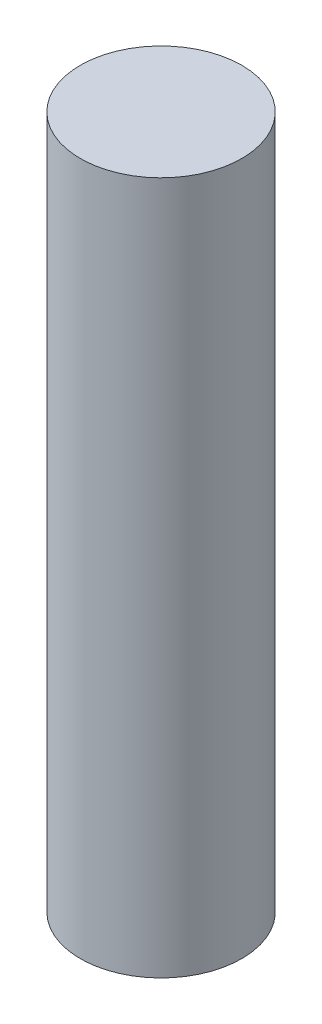
ISO-10303-21;
HEADER;
FILE_DESCRIPTION(('STEP AP214'),'2;1');
FILE_NAME('part.step','',(''),(''),'','','');
FILE_SCHEMA(('AUTOMOTIVE_DESIGN { 1 0 10303 214 1 1 1 1 }'));
ENDSEC;
DATA;
#1=APPLICATION_CONTEXT('core data for automotive mechanical design processes');
#2=APPLICATION_PROTOCOL_DEFINITION('international standard','automotive_design',2000,#1);
#3=PRODUCT_CONTEXT('',#1,'mechanical');
#4=PRODUCT('Part','Part','',(#3));
#5=PRODUCT_RELATED_PRODUCT_CATEGORY('part','',(#4));
#6=PRODUCT_DEFINITION_FORMATION('','',#4);
#7=PRODUCT_DEFINITION_CONTEXT('part definition',#1,'design');
#8=PRODUCT_DEFINITION('design','',#6,#7);
#9=PRODUCT_DEFINITION_SHAPE('','',#8);
#10=(LENGTH_UNIT() NAMED_UNIT(*) SI_UNIT(.MILLI.,.METRE.));
#11=(NAMED_UNIT(*) PLANE_ANGLE_UNIT() SI_UNIT($,.RADIAN.));
#12=(NAMED_UNIT(*) SI_UNIT($,.STERADIAN.) SOLID_ANGLE_UNIT());
#13=UNCERTAINTY_MEASURE_WITH_UNIT(LENGTH_MEASURE(1.E-05),#10,'distance_accuracy_value','');
#14=(GEOMETRIC_REPRESENTATION_CONTEXT(3) GLOBAL_UNCERTAINTY_ASSIGNED_CONTEXT((#13)) GLOBAL_UNIT_ASSIGNED_CONTEXT((#10,
#11,#12)) REPRESENTATION_CONTEXT('',''));
#15=CARTESIAN_POINT('',(0.,0.,0.));
#16=DIRECTION('',(0.,0.,1.));
#17=DIRECTION('',(1.,0.,0.));
#18=AXIS2_PLACEMENT_3D('',#15,#16,#17);
#19=CARTESIAN_POINT('',(5.,58.6,-20.6803059376936));
#20=DIRECTION('',(0.,1.,0.));
#21=DIRECTION('',(0.,0.,1.));
#22=AXIS2_PLACEMENT_3D('',#19,#20,#21);
#23=PLANE('',#22);
#24=CARTESIAN_POINT('',(0.,58.6,0.));
#25=DIRECTION('',(0.,-1.,0.));
#26=DIRECTION('',(0.,0.,-1.));
#27=AXIS2_PLACEMENT_3D('',#24,#25,#26);
#28=CIRCLE('',#27,5.);
#29=CARTESIAN_POINT('',(0.,58.6,-5.));
#30=VERTEX_POINT('',#29);
#31=EDGE_CURVE('E10',#30,#30,#28,.T.);
#32=ORIENTED_EDGE('',*,*,#31,.T.);
#33=EDGE_LOOP('',(#32));
#34=FACE_BOUND('',#33,.T.);
#35=ADVANCED_FACE('F33',(#34),#23,.F.);
#36=CARTESIAN_POINT('',(0.,20.2,0.));
#37=DIRECTION('',(0.,-1.,0.));
#38=DIRECTION('',(0.,0.,-1.));
#39=AXIS2_PLACEMENT_3D('',#36,#37,#38);
#40=CYLINDRICAL_SURFACE('',#39,5.);
#41=CARTESIAN_POINT('',(0.,101.5,0.));
#42=DIRECTION('',(0.,-1.,0.));
#43=DIRECTION('',(0.,0.,-1.));
#44=AXIS2_PLACEMENT_3D('',#41,#42,#43);
#45=CIRCLE('',#44,5.);
#46=CARTESIAN_POINT('',(0.,101.5,-5.));
#47=VERTEX_POINT('',#46);
#48=EDGE_CURVE('E39',#47,#47,#45,.T.);
#49=ORIENTED_EDGE('',*,*,#48,.T.);
#50=EDGE_LOOP('',(#49));
#51=FACE_BOUND('',#50,.T.);
#52=ORIENTED_EDGE('',*,*,#31,.F.);
#53=EDGE_LOOP('',(#52));
#54=FACE_BOUND('',#53,.T.);
#55=ADVANCED_FACE('F45',(#51,#54),#40,.T.);
#56=CARTESIAN_POINT('',(0.,101.5,0.));
#57=DIRECTION('',(0.,1.,0.));
#58=DIRECTION('',(0.,0.,1.));
#59=AXIS2_PLACEMENT_3D('',#56,#57,#58);
#60=PLANE('',#59);
#61=ORIENTED_EDGE('',*,*,#48,.F.);
#62=EDGE_LOOP('',(#61));
#63=FACE_BOUND('',#62,.T.);
#64=ADVANCED_FACE('F48',(#63),#60,.T.);
#65=CLOSED_SHELL('',(#35,#55,#64));
#66=MANIFOLD_SOLID_BREP('B2',#65);
#67=ADVANCED_BREP_SHAPE_REPRESENTATION('',(#18,#66),#14);
#68=SHAPE_DEFINITION_REPRESENTATION(#9,#67);
ENDSEC;
END-ISO-10303-21;
